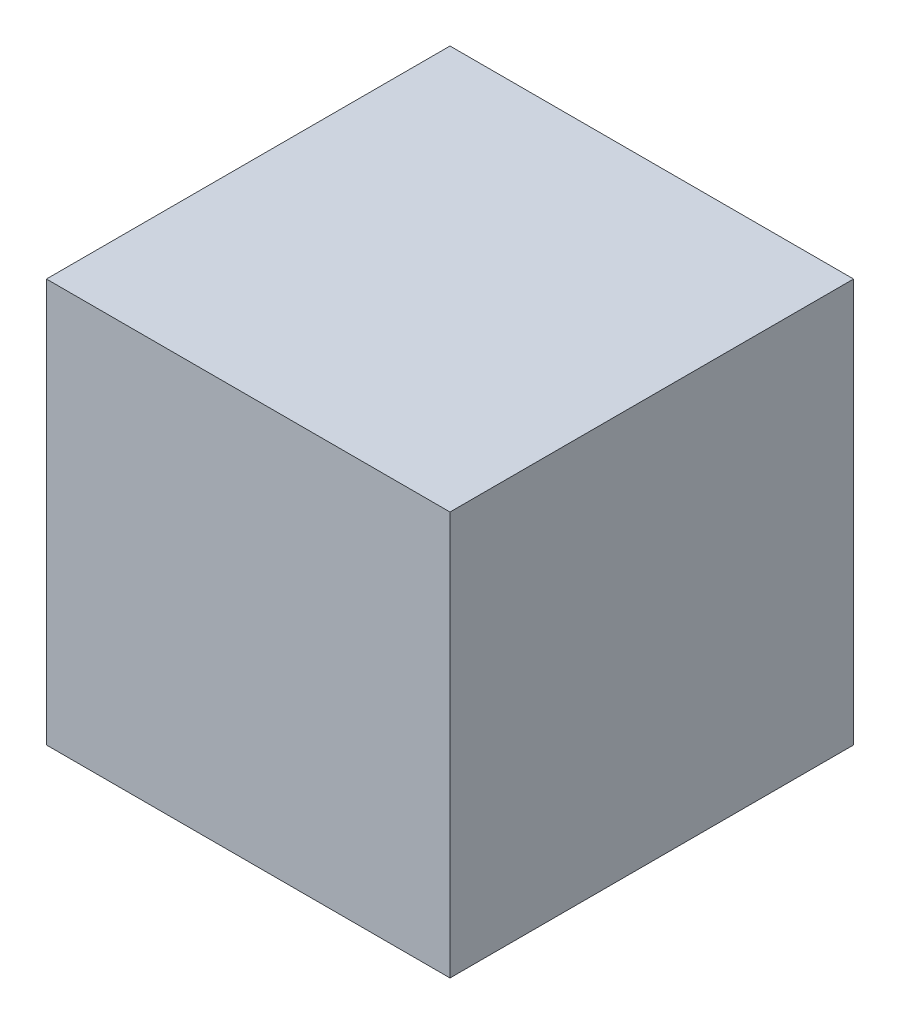
ISO-10303-21;
HEADER;
FILE_DESCRIPTION(('STEP AP214'),'2;1');
FILE_NAME('part.step','',(''),(''),'','','');
FILE_SCHEMA(('AUTOMOTIVE_DESIGN { 1 0 10303 214 1 1 1 1 }'));
ENDSEC;
DATA;
#1=APPLICATION_CONTEXT('core data for automotive mechanical design processes');
#2=APPLICATION_PROTOCOL_DEFINITION('international standard','automotive_design',2000,#1);
#3=PRODUCT_CONTEXT('',#1,'mechanical');
#4=PRODUCT('Part','Part','',(#3));
#5=PRODUCT_RELATED_PRODUCT_CATEGORY('part','',(#4));
#6=PRODUCT_DEFINITION_FORMATION('','',#4);
#7=PRODUCT_DEFINITION_CONTEXT('part definition',#1,'design');
#8=PRODUCT_DEFINITION('design','',#6,#7);
#9=PRODUCT_DEFINITION_SHAPE('','',#8);
#10=(LENGTH_UNIT() NAMED_UNIT(*) SI_UNIT(.MILLI.,.METRE.));
#11=(NAMED_UNIT(*) PLANE_ANGLE_UNIT() SI_UNIT($,.RADIAN.));
#12=(NAMED_UNIT(*) SI_UNIT($,.STERADIAN.) SOLID_ANGLE_UNIT());
#13=UNCERTAINTY_MEASURE_WITH_UNIT(LENGTH_MEASURE(1.E-05),#10,'distance_accuracy_value','');
#14=(GEOMETRIC_REPRESENTATION_CONTEXT(3) GLOBAL_UNCERTAINTY_ASSIGNED_CONTEXT((#13)) GLOBAL_UNIT_ASSIGNED_CONTEXT((#10,
#11,#12)) REPRESENTATION_CONTEXT('',''));
#15=CARTESIAN_POINT('',(0.,0.,0.));
#16=DIRECTION('',(0.,0.,1.));
#17=DIRECTION('',(1.,0.,0.));
#18=AXIS2_PLACEMENT_3D('',#15,#16,#17);
#19=CARTESIAN_POINT('',(0.,304.8,0.));
#20=DIRECTION('',(1.,0.,0.));
#21=DIRECTION('',(0.,0.,-1.));
#22=AXIS2_PLACEMENT_3D('',#19,#20,#21);
#23=PLANE('',#22);
#24=DIRECTION('',(0.,0.,1.));
#25=VECTOR('',#24,1.);
#26=CARTESIAN_POINT('',(0.,0.,0.));
#27=LINE('',#26,#25);
#28=CARTESIAN_POINT('',(0.,0.,-304.8));
#29=VERTEX_POINT('',#28);
#30=CARTESIAN_POINT('',(0.,0.,0.));
#31=VERTEX_POINT('',#30);
#32=EDGE_CURVE('E96',#29,#31,#27,.T.);
#33=ORIENTED_EDGE('',*,*,#32,.T.);
#34=DIRECTION('',(0.,-1.,0.));
#35=VECTOR('',#34,1.);
#36=CARTESIAN_POINT('',(0.,304.8,0.));
#37=LINE('',#36,#35);
#38=CARTESIAN_POINT('',(0.,304.8,0.));
#39=VERTEX_POINT('',#38);
#40=EDGE_CURVE('E11',#39,#31,#37,.T.);
#41=ORIENTED_EDGE('',*,*,#40,.F.);
#42=DIRECTION('',(0.,0.,1.));
#43=VECTOR('',#42,1.);
#44=CARTESIAN_POINT('',(0.,304.8,0.));
#45=LINE('',#44,#43);
#46=CARTESIAN_POINT('',(0.,304.8,-304.8));
#47=VERTEX_POINT('',#46);
#48=EDGE_CURVE('E84',#47,#39,#45,.T.);
#49=ORIENTED_EDGE('',*,*,#48,.F.);
#50=DIRECTION('',(0.,-1.,0.));
#51=VECTOR('',#50,1.);
#52=CARTESIAN_POINT('',(0.,304.8,-304.8));
#53=LINE('',#52,#51);
#54=EDGE_CURVE('E92',#47,#29,#53,.T.);
#55=ORIENTED_EDGE('',*,*,#54,.T.);
#56=EDGE_LOOP('',(#33,#41,#49,#55));
#57=FACE_BOUND('',#56,.T.);
#58=ADVANCED_FACE('F33',(#57),#23,.F.);
#59=CARTESIAN_POINT('',(0.,304.8,0.));
#60=DIRECTION('',(0.,0.,-1.));
#61=DIRECTION('',(-1.,0.,0.));
#62=AXIS2_PLACEMENT_3D('',#59,#60,#61);
#63=PLANE('',#62);
#64=DIRECTION('',(1.,0.,0.));
#65=VECTOR('',#64,1.);
#66=CARTESIAN_POINT('',(0.,0.,0.));
#67=LINE('',#66,#65);
#68=CARTESIAN_POINT('',(304.8,0.,0.));
#69=VERTEX_POINT('',#68);
#70=EDGE_CURVE('E88',#31,#69,#67,.T.);
#71=ORIENTED_EDGE('',*,*,#70,.T.);
#72=DIRECTION('',(0.,-1.,0.));
#73=VECTOR('',#72,1.);
#74=CARTESIAN_POINT('',(304.8,304.8,0.));
#75=LINE('',#74,#73);
#76=CARTESIAN_POINT('',(304.8,304.8,0.));
#77=VERTEX_POINT('',#76);
#78=EDGE_CURVE('E41',#77,#69,#75,.T.);
#79=ORIENTED_EDGE('',*,*,#78,.F.);
#80=DIRECTION('',(1.,0.,0.));
#81=VECTOR('',#80,1.);
#82=CARTESIAN_POINT('',(0.,304.8,0.));
#83=LINE('',#82,#81);
#84=EDGE_CURVE('E79',#39,#77,#83,.T.);
#85=ORIENTED_EDGE('',*,*,#84,.F.);
#86=ORIENTED_EDGE('',*,*,#40,.T.);
#87=EDGE_LOOP('',(#71,#79,#85,#86));
#88=FACE_BOUND('',#87,.T.);
#89=ADVANCED_FACE('F87',(#88),#63,.F.);
#90=CARTESIAN_POINT('',(304.8,304.8,0.));
#91=DIRECTION('',(-1.,0.,0.));
#92=DIRECTION('',(0.,0.,1.));
#93=AXIS2_PLACEMENT_3D('',#90,#91,#92);
#94=PLANE('',#93);
#95=DIRECTION('',(0.,0.,-1.));
#96=VECTOR('',#95,1.);
#97=CARTESIAN_POINT('',(304.8,0.,0.));
#98=LINE('',#97,#96);
#99=CARTESIAN_POINT('',(304.8,0.,-304.8));
#100=VERTEX_POINT('',#99);
#101=EDGE_CURVE('E66',#69,#100,#98,.T.);
#102=ORIENTED_EDGE('',*,*,#101,.T.);
#103=DIRECTION('',(0.,-1.,0.));
#104=VECTOR('',#103,1.);
#105=CARTESIAN_POINT('',(304.8,304.8,-304.8));
#106=LINE('',#105,#104);
#107=CARTESIAN_POINT('',(304.8,304.8,-304.8));
#108=VERTEX_POINT('',#107);
#109=EDGE_CURVE('E89',#108,#100,#106,.T.);
#110=ORIENTED_EDGE('',*,*,#109,.F.);
#111=DIRECTION('',(0.,0.,-1.));
#112=VECTOR('',#111,1.);
#113=CARTESIAN_POINT('',(304.8,304.8,0.));
#114=LINE('',#113,#112);
#115=EDGE_CURVE('E82',#77,#108,#114,.T.);
#116=ORIENTED_EDGE('',*,*,#115,.F.);
#117=ORIENTED_EDGE('',*,*,#78,.T.);
#118=EDGE_LOOP('',(#102,#110,#116,#117));
#119=FACE_BOUND('',#118,.T.);
#120=ADVANCED_FACE('F90',(#119),#94,.F.);
#121=CARTESIAN_POINT('',(0.,304.8,-304.8));
#122=DIRECTION('',(0.,0.,1.));
#123=DIRECTION('',(1.,0.,0.));
#124=AXIS2_PLACEMENT_3D('',#121,#122,#123);
#125=PLANE('',#124);
#126=DIRECTION('',(-1.,0.,0.));
#127=VECTOR('',#126,1.);
#128=CARTESIAN_POINT('',(0.,0.,-304.8));
#129=LINE('',#128,#127);
#130=EDGE_CURVE('E72',#100,#29,#129,.T.);
#131=ORIENTED_EDGE('',*,*,#130,.T.);
#132=ORIENTED_EDGE('',*,*,#54,.F.);
#133=DIRECTION('',(-1.,0.,0.));
#134=VECTOR('',#133,1.);
#135=CARTESIAN_POINT('',(0.,304.8,-304.8));
#136=LINE('',#135,#134);
#137=EDGE_CURVE('E49',#108,#47,#136,.T.);
#138=ORIENTED_EDGE('',*,*,#137,.F.);
#139=ORIENTED_EDGE('',*,*,#109,.T.);
#140=EDGE_LOOP('',(#131,#132,#138,#139));
#141=FACE_BOUND('',#140,.T.);
#142=ADVANCED_FACE('F103',(#141),#125,.F.);
#143=CARTESIAN_POINT('',(0.,304.8,0.));
#144=DIRECTION('',(0.,-1.,0.));
#145=DIRECTION('',(0.,0.,-1.));
#146=AXIS2_PLACEMENT_3D('',#143,#144,#145);
#147=PLANE('',#146);
#148=ORIENTED_EDGE('',*,*,#48,.T.);
#149=ORIENTED_EDGE('',*,*,#84,.T.);
#150=ORIENTED_EDGE('',*,*,#115,.T.);
#151=ORIENTED_EDGE('',*,*,#137,.T.);
#152=EDGE_LOOP('',(#148,#149,#150,#151));
#153=FACE_BOUND('',#152,.T.);
#154=ADVANCED_FACE('F80',(#153),#147,.F.);
#155=CARTESIAN_POINT('',(0.,0.,0.));
#156=DIRECTION('',(0.,-1.,0.));
#157=DIRECTION('',(0.,0.,-1.));
#158=AXIS2_PLACEMENT_3D('',#155,#156,#157);
#159=PLANE('',#158);
#160=ORIENTED_EDGE('',*,*,#32,.F.);
#161=ORIENTED_EDGE('',*,*,#130,.F.);
#162=ORIENTED_EDGE('',*,*,#101,.F.);
#163=ORIENTED_EDGE('',*,*,#70,.F.);
#164=EDGE_LOOP('',(#160,#161,#162,#163));
#165=FACE_BOUND('',#164,.T.);
#166=ADVANCED_FACE('F106',(#165),#159,.T.);
#167=CLOSED_SHELL('',(#58,#89,#120,#142,#154,#166));
#168=MANIFOLD_SOLID_BREP('B2',#167);
#169=ADVANCED_BREP_SHAPE_REPRESENTATION('',(#18,#168),#14);
#170=SHAPE_DEFINITION_REPRESENTATION(#9,#169);
ENDSEC;
END-ISO-10303-21;
